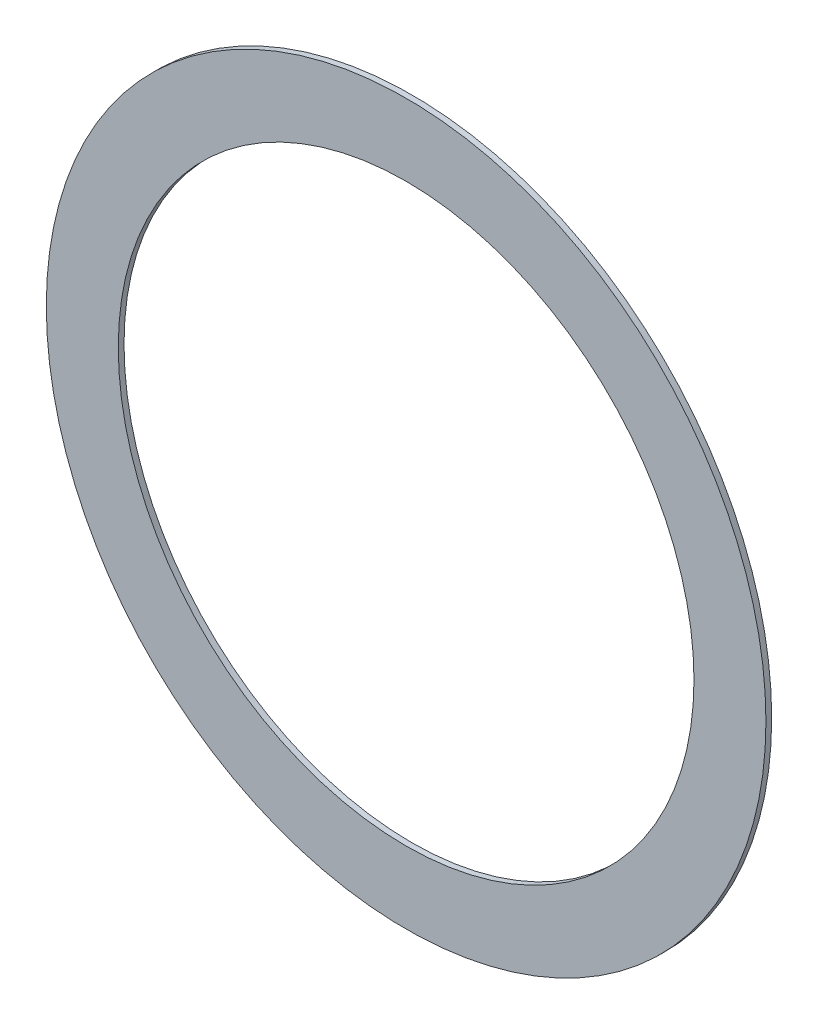
ISO-10303-21;
HEADER;
FILE_DESCRIPTION(('STEP AP214'),'2;1');
FILE_NAME('part.step','',(''),(''),'','','');
FILE_SCHEMA(('AUTOMOTIVE_DESIGN { 1 0 10303 214 1 1 1 1 }'));
ENDSEC;
DATA;
#1=APPLICATION_CONTEXT('core data for automotive mechanical design processes');
#2=APPLICATION_PROTOCOL_DEFINITION('international standard','automotive_design',2000,#1);
#3=PRODUCT_CONTEXT('',#1,'mechanical');
#4=PRODUCT('Part','Part','',(#3));
#5=PRODUCT_RELATED_PRODUCT_CATEGORY('part','',(#4));
#6=PRODUCT_DEFINITION_FORMATION('','',#4);
#7=PRODUCT_DEFINITION_CONTEXT('part definition',#1,'design');
#8=PRODUCT_DEFINITION('design','',#6,#7);
#9=PRODUCT_DEFINITION_SHAPE('','',#8);
#10=(LENGTH_UNIT() NAMED_UNIT(*) SI_UNIT(.MILLI.,.METRE.));
#11=(NAMED_UNIT(*) PLANE_ANGLE_UNIT() SI_UNIT($,.RADIAN.));
#12=(NAMED_UNIT(*) SI_UNIT($,.STERADIAN.) SOLID_ANGLE_UNIT());
#13=UNCERTAINTY_MEASURE_WITH_UNIT(LENGTH_MEASURE(1.E-05),#10,'distance_accuracy_value','');
#14=(GEOMETRIC_REPRESENTATION_CONTEXT(3) GLOBAL_UNCERTAINTY_ASSIGNED_CONTEXT((#13)) GLOBAL_UNIT_ASSIGNED_CONTEXT((#10,
#11,#12)) REPRESENTATION_CONTEXT('',''));
#15=CARTESIAN_POINT('',(0.,0.,0.));
#16=DIRECTION('',(0.,0.,1.));
#17=DIRECTION('',(1.,0.,0.));
#18=AXIS2_PLACEMENT_3D('',#15,#16,#17);
#19=CARTESIAN_POINT('',(0.,0.,0.1));
#20=DIRECTION('',(0.,0.,-1.));
#21=DIRECTION('',(-1.,0.,0.));
#22=AXIS2_PLACEMENT_3D('',#19,#20,#21);
#23=CYLINDRICAL_SURFACE('',#22,5.);
#24=CARTESIAN_POINT('',(0.,0.,0.1));
#25=DIRECTION('',(0.,0.,1.));
#26=DIRECTION('',(1.,0.,0.));
#27=AXIS2_PLACEMENT_3D('',#24,#25,#26);
#28=CIRCLE('',#27,5.);
#29=CARTESIAN_POINT('',(5.,0.,0.1));
#30=VERTEX_POINT('',#29);
#31=EDGE_CURVE('E38',#30,#30,#28,.T.);
#32=ORIENTED_EDGE('',*,*,#31,.T.);
#33=EDGE_LOOP('',(#32));
#34=FACE_BOUND('',#33,.T.);
#35=CARTESIAN_POINT('',(0.,0.,0.));
#36=DIRECTION('',(0.,0.,1.));
#37=DIRECTION('',(1.,0.,0.));
#38=AXIS2_PLACEMENT_3D('',#35,#36,#37);
#39=CIRCLE('',#38,5.);
#40=CARTESIAN_POINT('',(5.,0.,0.));
#41=VERTEX_POINT('',#40);
#42=EDGE_CURVE('E44',#41,#41,#39,.T.);
#43=ORIENTED_EDGE('',*,*,#42,.F.);
#44=EDGE_LOOP('',(#43));
#45=FACE_BOUND('',#44,.T.);
#46=ADVANCED_FACE('F31',(#34,#45),#23,.F.);
#47=CARTESIAN_POINT('',(0.,0.,0.1));
#48=DIRECTION('',(0.,0.,-1.));
#49=DIRECTION('',(-1.,0.,0.));
#50=AXIS2_PLACEMENT_3D('',#47,#48,#49);
#51=CYLINDRICAL_SURFACE('',#50,6.25);
#52=CARTESIAN_POINT('',(0.,0.,0.1));
#53=DIRECTION('',(0.,0.,1.));
#54=DIRECTION('',(1.,0.,0.));
#55=AXIS2_PLACEMENT_3D('',#52,#53,#54);
#56=CIRCLE('',#55,6.25);
#57=CARTESIAN_POINT('',(6.25,0.,0.1));
#58=VERTEX_POINT('',#57);
#59=EDGE_CURVE('E10',#58,#58,#56,.T.);
#60=ORIENTED_EDGE('',*,*,#59,.F.);
#61=EDGE_LOOP('',(#60));
#62=FACE_BOUND('',#61,.T.);
#63=CARTESIAN_POINT('',(0.,0.,0.));
#64=DIRECTION('',(0.,0.,1.));
#65=DIRECTION('',(1.,0.,0.));
#66=AXIS2_PLACEMENT_3D('',#63,#64,#65);
#67=CIRCLE('',#66,6.25);
#68=CARTESIAN_POINT('',(6.25,0.,0.));
#69=VERTEX_POINT('',#68);
#70=EDGE_CURVE('E34',#69,#69,#67,.T.);
#71=ORIENTED_EDGE('',*,*,#70,.T.);
#72=EDGE_LOOP('',(#71));
#73=FACE_BOUND('',#72,.T.);
#74=ADVANCED_FACE('F51',(#62,#73),#51,.T.);
#75=CARTESIAN_POINT('',(0.,0.,0.1));
#76=DIRECTION('',(0.,0.,1.));
#77=DIRECTION('',(1.,0.,0.));
#78=AXIS2_PLACEMENT_3D('',#75,#76,#77);
#79=PLANE('',#78);
#80=ORIENTED_EDGE('',*,*,#31,.F.);
#81=EDGE_LOOP('',(#80));
#82=FACE_BOUND('',#81,.T.);
#83=ORIENTED_EDGE('',*,*,#59,.T.);
#84=EDGE_LOOP('',(#83));
#85=FACE_BOUND('',#84,.T.);
#86=ADVANCED_FACE('F55',(#82,#85),#79,.T.);
#87=CARTESIAN_POINT('',(0.,0.,0.));
#88=DIRECTION('',(0.,0.,1.));
#89=DIRECTION('',(1.,0.,0.));
#90=AXIS2_PLACEMENT_3D('',#87,#88,#89);
#91=PLANE('',#90);
#92=ORIENTED_EDGE('',*,*,#42,.T.);
#93=EDGE_LOOP('',(#92));
#94=FACE_BOUND('',#93,.T.);
#95=ORIENTED_EDGE('',*,*,#70,.F.);
#96=EDGE_LOOP('',(#95));
#97=FACE_BOUND('',#96,.T.);
#98=ADVANCED_FACE('F53',(#94,#97),#91,.F.);
#99=CLOSED_SHELL('',(#46,#74,#86,#98));
#100=MANIFOLD_SOLID_BREP('B2',#99);
#101=ADVANCED_BREP_SHAPE_REPRESENTATION('',(#18,#100),#14);
#102=SHAPE_DEFINITION_REPRESENTATION(#9,#101);
ENDSEC;
END-ISO-10303-21;
